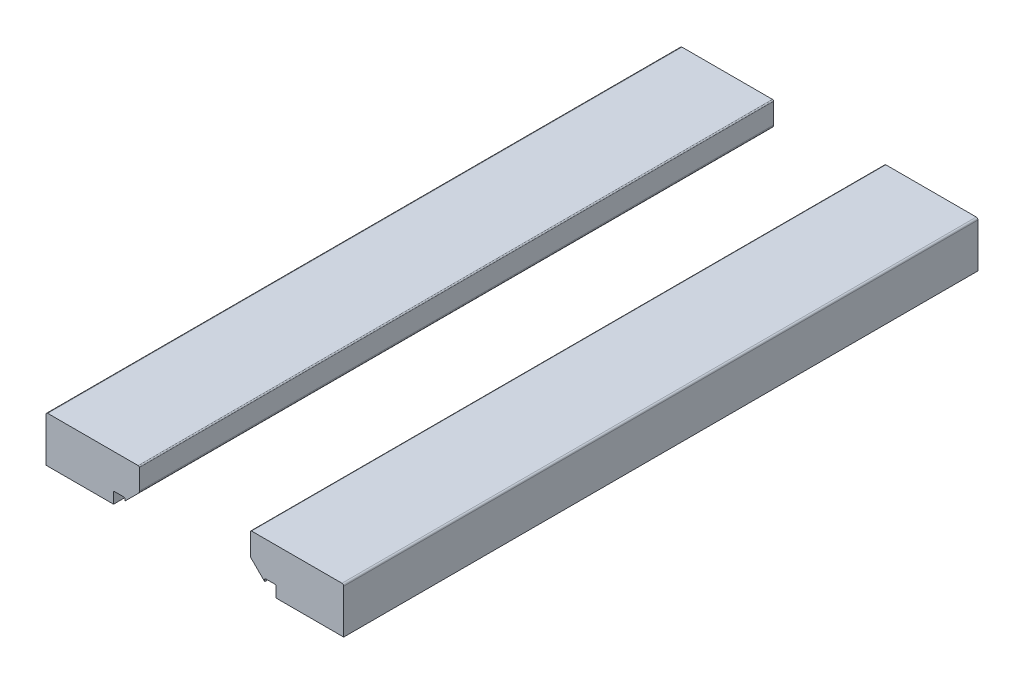
ISO-10303-21;
HEADER;
FILE_DESCRIPTION(('STEP AP214'),'2;1');
FILE_NAME('part.step','',(''),(''),'','','');
FILE_SCHEMA(('AUTOMOTIVE_DESIGN { 1 0 10303 214 1 1 1 1 }'));
ENDSEC;
DATA;
#1=APPLICATION_CONTEXT('core data for automotive mechanical design processes');
#2=APPLICATION_PROTOCOL_DEFINITION('international standard','automotive_design',2000,#1);
#3=PRODUCT_CONTEXT('',#1,'mechanical');
#4=PRODUCT('Part','Part','',(#3));
#5=PRODUCT_RELATED_PRODUCT_CATEGORY('part','',(#4));
#6=PRODUCT_DEFINITION_FORMATION('','',#4);
#7=PRODUCT_DEFINITION_CONTEXT('part definition',#1,'design');
#8=PRODUCT_DEFINITION('design','',#6,#7);
#9=PRODUCT_DEFINITION_SHAPE('','',#8);
#10=(LENGTH_UNIT() NAMED_UNIT(*) SI_UNIT(.MILLI.,.METRE.));
#11=(NAMED_UNIT(*) PLANE_ANGLE_UNIT() SI_UNIT($,.RADIAN.));
#12=(NAMED_UNIT(*) SI_UNIT($,.STERADIAN.) SOLID_ANGLE_UNIT());
#13=UNCERTAINTY_MEASURE_WITH_UNIT(LENGTH_MEASURE(1.E-05),#10,'distance_accuracy_value','');
#14=(GEOMETRIC_REPRESENTATION_CONTEXT(3) GLOBAL_UNCERTAINTY_ASSIGNED_CONTEXT((#13)) GLOBAL_UNIT_ASSIGNED_CONTEXT((#10,
#11,#12)) REPRESENTATION_CONTEXT('',''));
#15=CARTESIAN_POINT('',(0.,0.,0.));
#16=DIRECTION('',(0.,0.,1.));
#17=DIRECTION('',(1.,0.,0.));
#18=AXIS2_PLACEMENT_3D('',#15,#16,#17);
#19=CARTESIAN_POINT('',(-5.15,6.41568542494924,-27.7));
#20=DIRECTION('',(0.,0.,1.));
#21=DIRECTION('',(1.,0.,0.));
#22=AXIS2_PLACEMENT_3D('',#19,#20,#21);
#23=CYLINDRICAL_SURFACE('',#22,0.300000000000001);
#24=CARTESIAN_POINT('',(-5.15,6.41568542494924,27.7));
#25=DIRECTION('',(0.,0.,1.));
#26=DIRECTION('',(-1.,0.,0.));
#27=AXIS2_PLACEMENT_3D('',#24,#25,#26);
#28=CIRCLE('',#27,0.300000000000001);
#29=CARTESIAN_POINT('',(-4.93786796564403,6.20355339059327,27.7));
#30=VERTEX_POINT('',#29);
#31=CARTESIAN_POINT('',(-4.85,6.41568542494923,27.7));
#32=VERTEX_POINT('',#31);
#33=EDGE_CURVE('E171',#30,#32,#28,.T.);
#34=ORIENTED_EDGE('',*,*,#33,.F.);
#35=DIRECTION('',(0.,0.,1.));
#36=VECTOR('',#35,1.);
#37=CARTESIAN_POINT('',(-4.93786796564403,6.20355339059327,-27.7));
#38=LINE('',#37,#36);
#39=CARTESIAN_POINT('',(-4.93786796564403,6.20355339059327,-27.7));
#40=VERTEX_POINT('',#39);
#41=EDGE_CURVE('E12',#40,#30,#38,.T.);
#42=ORIENTED_EDGE('',*,*,#41,.F.);
#43=CARTESIAN_POINT('',(-5.15,6.41568542494924,-27.7));
#44=DIRECTION('',(0.,0.,1.));
#45=DIRECTION('',(-1.,0.,0.));
#46=AXIS2_PLACEMENT_3D('',#43,#44,#45);
#47=CIRCLE('',#46,0.300000000000001);
#48=CARTESIAN_POINT('',(-4.85,6.41568542494923,-27.7));
#49=VERTEX_POINT('',#48);
#50=EDGE_CURVE('E206',#40,#49,#47,.T.);
#51=ORIENTED_EDGE('',*,*,#50,.T.);
#52=DIRECTION('',(0.,0.,1.));
#53=VECTOR('',#52,1.);
#54=CARTESIAN_POINT('',(-4.85,6.41568542494923,-27.7));
#55=LINE('',#54,#53);
#56=EDGE_CURVE('E47',#49,#32,#55,.T.);
#57=ORIENTED_EDGE('',*,*,#56,.T.);
#58=EDGE_LOOP('',(#34,#42,#51,#57));
#59=FACE_BOUND('',#58,.T.);
#60=ADVANCED_FACE('F44',(#59),#23,.T.);
#61=CARTESIAN_POINT('',(-4.93786796564403,6.20355339059327,-27.7));
#62=DIRECTION('',(0.707106781186547,-0.707106781186548,0.));
#63=DIRECTION('',(0.707106781186548,0.707106781186547,0.));
#64=AXIS2_PLACEMENT_3D('',#61,#62,#63);
#65=PLANE('',#64);
#66=DIRECTION('',(0.707106781186548,0.707106781186547,0.));
#67=VECTOR('',#66,1.);
#68=CARTESIAN_POINT('',(-4.93786796564403,6.20355339059327,27.7));
#69=LINE('',#68,#67);
#70=CARTESIAN_POINT('',(-6.1,5.04142135623731,27.7));
#71=VERTEX_POINT('',#70);
#72=EDGE_CURVE('E204',#71,#30,#69,.T.);
#73=ORIENTED_EDGE('',*,*,#72,.F.);
#74=DIRECTION('',(0.,0.,1.));
#75=VECTOR('',#74,1.);
#76=CARTESIAN_POINT('',(-6.1,5.04142135623731,-27.7));
#77=LINE('',#76,#75);
#78=CARTESIAN_POINT('',(-6.1,5.04142135623731,-27.7));
#79=VERTEX_POINT('',#78);
#80=EDGE_CURVE('E53',#79,#71,#77,.T.);
#81=ORIENTED_EDGE('',*,*,#80,.F.);
#82=DIRECTION('',(0.707106781186548,0.707106781186547,0.));
#83=VECTOR('',#82,1.);
#84=CARTESIAN_POINT('',(-4.93786796564403,6.20355339059327,-27.7));
#85=LINE('',#84,#83);
#86=EDGE_CURVE('E161',#79,#40,#85,.T.);
#87=ORIENTED_EDGE('',*,*,#86,.T.);
#88=ORIENTED_EDGE('',*,*,#41,.T.);
#89=EDGE_LOOP('',(#73,#81,#87,#88));
#90=FACE_BOUND('',#89,.T.);
#91=ADVANCED_FACE('F228',(#90),#65,.T.);
#92=CARTESIAN_POINT('',(-6.1,5.2,-27.7));
#93=DIRECTION('',(-1.,0.,0.));
#94=DIRECTION('',(0.,-1.,0.));
#95=AXIS2_PLACEMENT_3D('',#92,#93,#94);
#96=PLANE('',#95);
#97=DIRECTION('',(0.,-1.,0.));
#98=VECTOR('',#97,1.);
#99=CARTESIAN_POINT('',(-6.1,5.2,27.7));
#100=LINE('',#99,#98);
#101=CARTESIAN_POINT('',(-6.1,5.2,27.7));
#102=VERTEX_POINT('',#101);
#103=EDGE_CURVE('E148',#102,#71,#100,.T.);
#104=ORIENTED_EDGE('',*,*,#103,.F.);
#105=DIRECTION('',(0.,0.,1.));
#106=VECTOR('',#105,1.);
#107=CARTESIAN_POINT('',(-6.1,5.2,-27.7));
#108=LINE('',#107,#106);
#109=CARTESIAN_POINT('',(-6.1,5.2,-27.7));
#110=VERTEX_POINT('',#109);
#111=EDGE_CURVE('E143',#110,#102,#108,.T.);
#112=ORIENTED_EDGE('',*,*,#111,.F.);
#113=DIRECTION('',(0.,-1.,0.));
#114=VECTOR('',#113,1.);
#115=CARTESIAN_POINT('',(-6.1,5.2,-27.7));
#116=LINE('',#115,#114);
#117=EDGE_CURVE('E146',#110,#79,#116,.T.);
#118=ORIENTED_EDGE('',*,*,#117,.T.);
#119=ORIENTED_EDGE('',*,*,#80,.T.);
#120=EDGE_LOOP('',(#104,#112,#118,#119));
#121=FACE_BOUND('',#120,.T.);
#122=ADVANCED_FACE('F145',(#121),#96,.T.);
#123=CARTESIAN_POINT('',(-6.2,5.2,-27.7));
#124=DIRECTION('',(0.,0.,1.));
#125=DIRECTION('',(1.,0.,0.));
#126=AXIS2_PLACEMENT_3D('',#123,#124,#125);
#127=CYLINDRICAL_SURFACE('',#126,0.1);
#128=CARTESIAN_POINT('',(-6.2,5.2,27.7));
#129=DIRECTION('',(0.,0.,-1.));
#130=DIRECTION('',(1.,0.,0.));
#131=AXIS2_PLACEMENT_3D('',#128,#129,#130);
#132=CIRCLE('',#131,0.1);
#133=CARTESIAN_POINT('',(-6.2,5.3,27.7));
#134=VERTEX_POINT('',#133);
#135=EDGE_CURVE('E201',#134,#102,#132,.T.);
#136=ORIENTED_EDGE('',*,*,#135,.F.);
#137=DIRECTION('',(0.,0.,1.));
#138=VECTOR('',#137,1.);
#139=CARTESIAN_POINT('',(-6.2,5.3,-27.7));
#140=LINE('',#139,#138);
#141=CARTESIAN_POINT('',(-6.2,5.3,-27.7));
#142=VERTEX_POINT('',#141);
#143=EDGE_CURVE('E153',#142,#134,#140,.T.);
#144=ORIENTED_EDGE('',*,*,#143,.F.);
#145=CARTESIAN_POINT('',(-6.2,5.2,-27.7));
#146=DIRECTION('',(0.,0.,-1.));
#147=DIRECTION('',(1.,0.,0.));
#148=AXIS2_PLACEMENT_3D('',#145,#146,#147);
#149=CIRCLE('',#148,0.1);
#150=EDGE_CURVE('E159',#142,#110,#149,.T.);
#151=ORIENTED_EDGE('',*,*,#150,.T.);
#152=ORIENTED_EDGE('',*,*,#111,.T.);
#153=EDGE_LOOP('',(#136,#144,#151,#152));
#154=FACE_BOUND('',#153,.T.);
#155=ADVANCED_FACE('F163',(#154),#127,.F.);
#156=CARTESIAN_POINT('',(-7.,5.3,-27.7));
#157=DIRECTION('',(0.,-1.,0.));
#158=DIRECTION('',(0.,0.,-1.));
#159=AXIS2_PLACEMENT_3D('',#156,#157,#158);
#160=PLANE('',#159);
#161=DIRECTION('',(1.,0.,0.));
#162=VECTOR('',#161,1.);
#163=CARTESIAN_POINT('',(-7.,5.3,27.7));
#164=LINE('',#163,#162);
#165=CARTESIAN_POINT('',(-7.,5.3,27.7));
#166=VERTEX_POINT('',#165);
#167=EDGE_CURVE('E198',#166,#134,#164,.T.);
#168=ORIENTED_EDGE('',*,*,#167,.F.);
#169=DIRECTION('',(0.,0.,1.));
#170=VECTOR('',#169,1.);
#171=CARTESIAN_POINT('',(-7.,5.3,-27.7));
#172=LINE('',#171,#170);
#173=CARTESIAN_POINT('',(-7.,5.3,-27.7));
#174=VERTEX_POINT('',#173);
#175=EDGE_CURVE('E210',#174,#166,#172,.T.);
#176=ORIENTED_EDGE('',*,*,#175,.F.);
#177=DIRECTION('',(1.,0.,0.));
#178=VECTOR('',#177,1.);
#179=CARTESIAN_POINT('',(-7.,5.3,-27.7));
#180=LINE('',#179,#178);
#181=EDGE_CURVE('E164',#174,#142,#180,.T.);
#182=ORIENTED_EDGE('',*,*,#181,.T.);
#183=ORIENTED_EDGE('',*,*,#143,.T.);
#184=EDGE_LOOP('',(#168,#176,#182,#183));
#185=FACE_BOUND('',#184,.T.);
#186=ADVANCED_FACE('F241',(#185),#160,.T.);
#187=CARTESIAN_POINT('',(-7.,5.2,-27.7));
#188=DIRECTION('',(0.,0.,1.));
#189=DIRECTION('',(1.,0.,0.));
#190=AXIS2_PLACEMENT_3D('',#187,#188,#189);
#191=CYLINDRICAL_SURFACE('',#190,0.1);
#192=CARTESIAN_POINT('',(-7.,5.2,27.7));
#193=DIRECTION('',(0.,0.,-1.));
#194=DIRECTION('',(1.,0.,0.));
#195=AXIS2_PLACEMENT_3D('',#192,#193,#194);
#196=CIRCLE('',#195,0.1);
#197=CARTESIAN_POINT('',(-7.1,5.2,27.7));
#198=VERTEX_POINT('',#197);
#199=EDGE_CURVE('E195',#198,#166,#196,.T.);
#200=ORIENTED_EDGE('',*,*,#199,.F.);
#201=DIRECTION('',(0.,0.,1.));
#202=VECTOR('',#201,1.);
#203=CARTESIAN_POINT('',(-7.1,5.2,-27.7));
#204=LINE('',#203,#202);
#205=CARTESIAN_POINT('',(-7.1,5.2,-27.7));
#206=VERTEX_POINT('',#205);
#207=EDGE_CURVE('E212',#206,#198,#204,.T.);
#208=ORIENTED_EDGE('',*,*,#207,.F.);
#209=CARTESIAN_POINT('',(-7.,5.2,-27.7));
#210=DIRECTION('',(0.,0.,-1.));
#211=DIRECTION('',(1.,0.,0.));
#212=AXIS2_PLACEMENT_3D('',#209,#210,#211);
#213=CIRCLE('',#212,0.1);
#214=EDGE_CURVE('E166',#206,#174,#213,.T.);
#215=ORIENTED_EDGE('',*,*,#214,.T.);
#216=ORIENTED_EDGE('',*,*,#175,.T.);
#217=EDGE_LOOP('',(#200,#208,#215,#216));
#218=FACE_BOUND('',#217,.T.);
#219=ADVANCED_FACE('F244',(#218),#191,.F.);
#220=CARTESIAN_POINT('',(-7.1,4.3,-27.7));
#221=DIRECTION('',(1.,0.,0.));
#222=DIRECTION('',(0.,0.,-1.));
#223=AXIS2_PLACEMENT_3D('',#220,#221,#222);
#224=PLANE('',#223);
#225=DIRECTION('',(0.,1.,0.));
#226=VECTOR('',#225,1.);
#227=CARTESIAN_POINT('',(-7.1,4.3,27.7));
#228=LINE('',#227,#226);
#229=CARTESIAN_POINT('',(-7.1,4.3,27.7));
#230=VERTEX_POINT('',#229);
#231=EDGE_CURVE('E192',#230,#198,#228,.T.);
#232=ORIENTED_EDGE('',*,*,#231,.F.);
#233=DIRECTION('',(0.,0.,1.));
#234=VECTOR('',#233,1.);
#235=CARTESIAN_POINT('',(-7.1,4.3,-27.7));
#236=LINE('',#235,#234);
#237=CARTESIAN_POINT('',(-7.1,4.3,-27.7));
#238=VERTEX_POINT('',#237);
#239=EDGE_CURVE('E214',#238,#230,#236,.T.);
#240=ORIENTED_EDGE('',*,*,#239,.F.);
#241=DIRECTION('',(0.,1.,0.));
#242=VECTOR('',#241,1.);
#243=CARTESIAN_POINT('',(-7.1,4.3,-27.7));
#244=LINE('',#243,#242);
#245=EDGE_CURVE('E384',#238,#206,#244,.T.);
#246=ORIENTED_EDGE('',*,*,#245,.T.);
#247=ORIENTED_EDGE('',*,*,#207,.T.);
#248=EDGE_LOOP('',(#232,#240,#246,#247));
#249=FACE_BOUND('',#248,.T.);
#250=ADVANCED_FACE('F248',(#249),#224,.T.);
#251=CARTESIAN_POINT('',(-7.1,4.3,-27.7));
#252=DIRECTION('',(0.,-1.,0.));
#253=DIRECTION('',(0.,0.,-1.));
#254=AXIS2_PLACEMENT_3D('',#251,#252,#253);
#255=PLANE('',#254);
#256=DIRECTION('',(1.,0.,0.));
#257=VECTOR('',#256,1.);
#258=CARTESIAN_POINT('',(-7.1,4.3,27.7));
#259=LINE('',#258,#257);
#260=CARTESIAN_POINT('',(-13.,4.3,27.7));
#261=VERTEX_POINT('',#260);
#262=EDGE_CURVE('E189',#261,#230,#259,.T.);
#263=ORIENTED_EDGE('',*,*,#262,.F.);
#264=DIRECTION('',(0.,0.,1.));
#265=VECTOR('',#264,1.);
#266=CARTESIAN_POINT('',(-13.,4.3,-27.7));
#267=LINE('',#266,#265);
#268=CARTESIAN_POINT('',(-13.,4.3,-27.7));
#269=VERTEX_POINT('',#268);
#270=EDGE_CURVE('E216',#269,#261,#267,.T.);
#271=ORIENTED_EDGE('',*,*,#270,.F.);
#272=DIRECTION('',(1.,0.,0.));
#273=VECTOR('',#272,1.);
#274=CARTESIAN_POINT('',(-7.1,4.3,-27.7));
#275=LINE('',#274,#273);
#276=EDGE_CURVE('E380',#269,#238,#275,.T.);
#277=ORIENTED_EDGE('',*,*,#276,.T.);
#278=ORIENTED_EDGE('',*,*,#239,.T.);
#279=EDGE_LOOP('',(#263,#271,#277,#278));
#280=FACE_BOUND('',#279,.T.);
#281=ADVANCED_FACE('F252',(#280),#255,.T.);
#282=CARTESIAN_POINT('',(-13.,8.15,-27.7));
#283=DIRECTION('',(-1.,0.,0.));
#284=DIRECTION('',(0.,-1.,0.));
#285=AXIS2_PLACEMENT_3D('',#282,#283,#284);
#286=PLANE('',#285);
#287=DIRECTION('',(0.,-1.,0.));
#288=VECTOR('',#287,1.);
#289=CARTESIAN_POINT('',(-13.,8.15,27.7));
#290=LINE('',#289,#288);
#291=CARTESIAN_POINT('',(-13.,8.15,27.7));
#292=VERTEX_POINT('',#291);
#293=EDGE_CURVE('E186',#292,#261,#290,.T.);
#294=ORIENTED_EDGE('',*,*,#293,.F.);
#295=DIRECTION('',(0.,0.,1.));
#296=VECTOR('',#295,1.);
#297=CARTESIAN_POINT('',(-13.,8.15,-27.7));
#298=LINE('',#297,#296);
#299=CARTESIAN_POINT('',(-13.,8.15,-27.7));
#300=VERTEX_POINT('',#299);
#301=EDGE_CURVE('E218',#300,#292,#298,.T.);
#302=ORIENTED_EDGE('',*,*,#301,.F.);
#303=DIRECTION('',(0.,-1.,0.));
#304=VECTOR('',#303,1.);
#305=CARTESIAN_POINT('',(-13.,8.15,-27.7));
#306=LINE('',#305,#304);
#307=EDGE_CURVE('E391',#300,#269,#306,.T.);
#308=ORIENTED_EDGE('',*,*,#307,.T.);
#309=ORIENTED_EDGE('',*,*,#270,.T.);
#310=EDGE_LOOP('',(#294,#302,#308,#309));
#311=FACE_BOUND('',#310,.T.);
#312=ADVANCED_FACE('F256',(#311),#286,.T.);
#313=CARTESIAN_POINT('',(-12.85,8.15,-27.7));
#314=DIRECTION('',(0.,0.,1.));
#315=DIRECTION('',(1.,0.,0.));
#316=AXIS2_PLACEMENT_3D('',#313,#314,#315);
#317=CYLINDRICAL_SURFACE('',#316,0.15);
#318=CARTESIAN_POINT('',(-12.85,8.15,27.7));
#319=DIRECTION('',(0.,0.,1.));
#320=DIRECTION('',(1.,0.,0.));
#321=AXIS2_PLACEMENT_3D('',#318,#319,#320);
#322=CIRCLE('',#321,0.15);
#323=CARTESIAN_POINT('',(-12.85,8.3,27.7));
#324=VERTEX_POINT('',#323);
#325=EDGE_CURVE('E183',#324,#292,#322,.T.);
#326=ORIENTED_EDGE('',*,*,#325,.F.);
#327=DIRECTION('',(0.,0.,1.));
#328=VECTOR('',#327,1.);
#329=CARTESIAN_POINT('',(-12.85,8.3,-27.7));
#330=LINE('',#329,#328);
#331=CARTESIAN_POINT('',(-12.85,8.3,-27.7));
#332=VERTEX_POINT('',#331);
#333=EDGE_CURVE('E220',#332,#324,#330,.T.);
#334=ORIENTED_EDGE('',*,*,#333,.F.);
#335=CARTESIAN_POINT('',(-12.85,8.15,-27.7));
#336=DIRECTION('',(0.,0.,1.));
#337=DIRECTION('',(1.,0.,0.));
#338=AXIS2_PLACEMENT_3D('',#335,#336,#337);
#339=CIRCLE('',#338,0.15);
#340=EDGE_CURVE('E373',#332,#300,#339,.T.);
#341=ORIENTED_EDGE('',*,*,#340,.T.);
#342=ORIENTED_EDGE('',*,*,#301,.T.);
#343=EDGE_LOOP('',(#326,#334,#341,#342));
#344=FACE_BOUND('',#343,.T.);
#345=ADVANCED_FACE('F260',(#344),#317,.T.);
#346=CARTESIAN_POINT('',(-4.95,8.3,-27.7));
#347=DIRECTION('',(0.,1.,0.));
#348=DIRECTION('',(-1.,0.,0.));
#349=AXIS2_PLACEMENT_3D('',#346,#347,#348);
#350=PLANE('',#349);
#351=DIRECTION('',(-1.,0.,0.));
#352=VECTOR('',#351,1.);
#353=CARTESIAN_POINT('',(-4.95,8.3,27.7));
#354=LINE('',#353,#352);
#355=CARTESIAN_POINT('',(-4.95,8.3,27.7));
#356=VERTEX_POINT('',#355);
#357=EDGE_CURVE('E180',#356,#324,#354,.T.);
#358=ORIENTED_EDGE('',*,*,#357,.F.);
#359=DIRECTION('',(0.,0.,1.));
#360=VECTOR('',#359,1.);
#361=CARTESIAN_POINT('',(-4.95,8.3,-27.7));
#362=LINE('',#361,#360);
#363=CARTESIAN_POINT('',(-4.95,8.3,-27.7));
#364=VERTEX_POINT('',#363);
#365=EDGE_CURVE('E222',#364,#356,#362,.T.);
#366=ORIENTED_EDGE('',*,*,#365,.F.);
#367=DIRECTION('',(-1.,0.,0.));
#368=VECTOR('',#367,1.);
#369=CARTESIAN_POINT('',(-4.95,8.3,-27.7));
#370=LINE('',#369,#368);
#371=EDGE_CURVE('E369',#364,#332,#370,.T.);
#372=ORIENTED_EDGE('',*,*,#371,.T.);
#373=ORIENTED_EDGE('',*,*,#333,.T.);
#374=EDGE_LOOP('',(#358,#366,#372,#373));
#375=FACE_BOUND('',#374,.T.);
#376=ADVANCED_FACE('F264',(#375),#350,.T.);
#377=CARTESIAN_POINT('',(-4.95,8.2,-27.7));
#378=DIRECTION('',(0.,0.,1.));
#379=DIRECTION('',(1.,0.,0.));
#380=AXIS2_PLACEMENT_3D('',#377,#378,#379);
#381=CYLINDRICAL_SURFACE('',#380,0.100000000000001);
#382=CARTESIAN_POINT('',(-4.95,8.2,27.7));
#383=DIRECTION('',(0.,0.,1.));
#384=DIRECTION('',(1.,0.,0.));
#385=AXIS2_PLACEMENT_3D('',#382,#383,#384);
#386=CIRCLE('',#385,0.100000000000001);
#387=CARTESIAN_POINT('',(-4.85,8.2,27.7));
#388=VERTEX_POINT('',#387);
#389=EDGE_CURVE('E177',#388,#356,#386,.T.);
#390=ORIENTED_EDGE('',*,*,#389,.F.);
#391=DIRECTION('',(0.,0.,1.));
#392=VECTOR('',#391,1.);
#393=CARTESIAN_POINT('',(-4.85,8.2,-27.7));
#394=LINE('',#393,#392);
#395=CARTESIAN_POINT('',(-4.85,8.2,-27.7));
#396=VERTEX_POINT('',#395);
#397=EDGE_CURVE('E223',#396,#388,#394,.T.);
#398=ORIENTED_EDGE('',*,*,#397,.F.);
#399=CARTESIAN_POINT('',(-4.95,8.2,-27.7));
#400=DIRECTION('',(0.,0.,1.));
#401=DIRECTION('',(1.,0.,0.));
#402=AXIS2_PLACEMENT_3D('',#399,#400,#401);
#403=CIRCLE('',#402,0.100000000000001);
#404=EDGE_CURVE('E395',#396,#364,#403,.T.);
#405=ORIENTED_EDGE('',*,*,#404,.T.);
#406=ORIENTED_EDGE('',*,*,#365,.T.);
#407=EDGE_LOOP('',(#390,#398,#405,#406));
#408=FACE_BOUND('',#407,.T.);
#409=ADVANCED_FACE('F268',(#408),#381,.T.);
#410=CARTESIAN_POINT('',(-4.85,8.2,-27.7));
#411=DIRECTION('',(1.,0.,0.));
#412=DIRECTION('',(0.,1.,0.));
#413=AXIS2_PLACEMENT_3D('',#410,#411,#412);
#414=PLANE('',#413);
#415=DIRECTION('',(0.,1.,0.));
#416=VECTOR('',#415,1.);
#417=CARTESIAN_POINT('',(-4.85,8.2,27.7));
#418=LINE('',#417,#416);
#419=EDGE_CURVE('E174',#32,#388,#418,.T.);
#420=ORIENTED_EDGE('',*,*,#419,.F.);
#421=ORIENTED_EDGE('',*,*,#56,.F.);
#422=DIRECTION('',(0.,1.,0.));
#423=VECTOR('',#422,1.);
#424=CARTESIAN_POINT('',(-4.85,8.2,-27.7));
#425=LINE('',#424,#423);
#426=EDGE_CURVE('E397',#49,#396,#425,.T.);
#427=ORIENTED_EDGE('',*,*,#426,.T.);
#428=ORIENTED_EDGE('',*,*,#397,.T.);
#429=EDGE_LOOP('',(#420,#421,#427,#428));
#430=FACE_BOUND('',#429,.T.);
#431=ADVANCED_FACE('F225',(#430),#414,.T.);
#432=CARTESIAN_POINT('',(-5.15,6.41568542494924,-27.7));
#433=DIRECTION('',(0.,0.,-1.));
#434=DIRECTION('',(-1.,0.,0.));
#435=AXIS2_PLACEMENT_3D('',#432,#433,#434);
#436=PLANE('',#435);
#437=ORIENTED_EDGE('',*,*,#50,.F.);
#438=ORIENTED_EDGE('',*,*,#86,.F.);
#439=ORIENTED_EDGE('',*,*,#117,.F.);
#440=ORIENTED_EDGE('',*,*,#150,.F.);
#441=ORIENTED_EDGE('',*,*,#181,.F.);
#442=ORIENTED_EDGE('',*,*,#214,.F.);
#443=ORIENTED_EDGE('',*,*,#245,.F.);
#444=ORIENTED_EDGE('',*,*,#276,.F.);
#445=ORIENTED_EDGE('',*,*,#307,.F.);
#446=ORIENTED_EDGE('',*,*,#340,.F.);
#447=ORIENTED_EDGE('',*,*,#371,.F.);
#448=ORIENTED_EDGE('',*,*,#404,.F.);
#449=ORIENTED_EDGE('',*,*,#426,.F.);
#450=EDGE_LOOP('',(#437,#438,#439,#440,#441,#442,#443,#444,#445,#446,#447,#448,#449));
#451=FACE_BOUND('',#450,.T.);
#452=ADVANCED_FACE('F157',(#451),#436,.T.);
#453=CARTESIAN_POINT('',(-5.15,6.41568542494924,27.7));
#454=DIRECTION('',(0.,0.,-1.));
#455=DIRECTION('',(-1.,0.,0.));
#456=AXIS2_PLACEMENT_3D('',#453,#454,#455);
#457=PLANE('',#456);
#458=ORIENTED_EDGE('',*,*,#33,.T.);
#459=ORIENTED_EDGE('',*,*,#419,.T.);
#460=ORIENTED_EDGE('',*,*,#389,.T.);
#461=ORIENTED_EDGE('',*,*,#357,.T.);
#462=ORIENTED_EDGE('',*,*,#325,.T.);
#463=ORIENTED_EDGE('',*,*,#293,.T.);
#464=ORIENTED_EDGE('',*,*,#262,.T.);
#465=ORIENTED_EDGE('',*,*,#231,.T.);
#466=ORIENTED_EDGE('',*,*,#199,.T.);
#467=ORIENTED_EDGE('',*,*,#167,.T.);
#468=ORIENTED_EDGE('',*,*,#135,.T.);
#469=ORIENTED_EDGE('',*,*,#103,.T.);
#470=ORIENTED_EDGE('',*,*,#72,.T.);
#471=EDGE_LOOP('',(#458,#459,#460,#461,#462,#463,#464,#465,#466,#467,#468,#469,#470));
#472=FACE_BOUND('',#471,.T.);
#473=ADVANCED_FACE('F227',(#472),#457,.F.);
#474=CLOSED_SHELL('',(#60,#91,#122,#155,#186,#219,#250,#281,#312,#345,#376,#409,#431,#452,#473));
#475=MANIFOLD_SOLID_BREP('B2',#474);
#476=CARTESIAN_POINT('',(12.85,8.15,-27.7));
#477=DIRECTION('',(0.,0.,1.));
#478=DIRECTION('',(1.,0.,0.));
#479=AXIS2_PLACEMENT_3D('',#476,#477,#478);
#480=CYLINDRICAL_SURFACE('',#479,0.15);
#481=CARTESIAN_POINT('',(12.85,8.15,27.7));
#482=DIRECTION('',(0.,0.,1.));
#483=DIRECTION('',(-1.,0.,0.));
#484=AXIS2_PLACEMENT_3D('',#481,#482,#483);
#485=CIRCLE('',#484,0.15);
#486=CARTESIAN_POINT('',(13.,8.15,27.7));
#487=VERTEX_POINT('',#486);
#488=CARTESIAN_POINT('',(12.85,8.3,27.7));
#489=VERTEX_POINT('',#488);
#490=EDGE_CURVE('E528',#487,#489,#485,.T.);
#491=ORIENTED_EDGE('',*,*,#490,.F.);
#492=DIRECTION('',(0.,0.,1.));
#493=VECTOR('',#492,1.);
#494=CARTESIAN_POINT('',(13.,8.15,-27.7));
#495=LINE('',#494,#493);
#496=CARTESIAN_POINT('',(13.,8.15,-27.7));
#497=VERTEX_POINT('',#496);
#498=EDGE_CURVE('E42',#497,#487,#495,.T.);
#499=ORIENTED_EDGE('',*,*,#498,.F.);
#500=CARTESIAN_POINT('',(12.85,8.15,-27.7));
#501=DIRECTION('',(0.,0.,1.));
#502=DIRECTION('',(-1.,0.,0.));
#503=AXIS2_PLACEMENT_3D('',#500,#501,#502);
#504=CIRCLE('',#503,0.15);
#505=CARTESIAN_POINT('',(12.85,8.3,-27.7));
#506=VERTEX_POINT('',#505);
#507=EDGE_CURVE('E563',#497,#506,#504,.T.);
#508=ORIENTED_EDGE('',*,*,#507,.T.);
#509=DIRECTION('',(0.,0.,1.));
#510=VECTOR('',#509,1.);
#511=CARTESIAN_POINT('',(12.85,8.3,-27.7));
#512=LINE('',#511,#510);
#513=EDGE_CURVE('E404',#506,#489,#512,.T.);
#514=ORIENTED_EDGE('',*,*,#513,.T.);
#515=EDGE_LOOP('',(#491,#499,#508,#514));
#516=FACE_BOUND('',#515,.T.);
#517=ADVANCED_FACE('F401',(#516),#480,.T.);
#518=CARTESIAN_POINT('',(13.,8.15,-27.7));
#519=DIRECTION('',(1.,0.,0.));
#520=DIRECTION('',(0.,1.,0.));
#521=AXIS2_PLACEMENT_3D('',#518,#519,#520);
#522=PLANE('',#521);
#523=DIRECTION('',(0.,1.,0.));
#524=VECTOR('',#523,1.);
#525=CARTESIAN_POINT('',(13.,8.15,27.7));
#526=LINE('',#525,#524);
#527=CARTESIAN_POINT('',(13.,4.3,27.7));
#528=VERTEX_POINT('',#527);
#529=EDGE_CURVE('E561',#528,#487,#526,.T.);
#530=ORIENTED_EDGE('',*,*,#529,.F.);
#531=DIRECTION('',(0.,0.,1.));
#532=VECTOR('',#531,1.);
#533=CARTESIAN_POINT('',(13.,4.3,-27.7));
#534=LINE('',#533,#532);
#535=CARTESIAN_POINT('',(13.,4.3,-27.7));
#536=VERTEX_POINT('',#535);
#537=EDGE_CURVE('E410',#536,#528,#534,.T.);
#538=ORIENTED_EDGE('',*,*,#537,.F.);
#539=DIRECTION('',(0.,1.,0.));
#540=VECTOR('',#539,1.);
#541=CARTESIAN_POINT('',(13.,8.15,-27.7));
#542=LINE('',#541,#540);
#543=EDGE_CURVE('E518',#536,#497,#542,.T.);
#544=ORIENTED_EDGE('',*,*,#543,.T.);
#545=ORIENTED_EDGE('',*,*,#498,.T.);
#546=EDGE_LOOP('',(#530,#538,#544,#545));
#547=FACE_BOUND('',#546,.T.);
#548=ADVANCED_FACE('F585',(#547),#522,.T.);
#549=CARTESIAN_POINT('',(7.1,4.3,-27.7));
#550=DIRECTION('',(0.,-1.,0.));
#551=DIRECTION('',(0.,0.,-1.));
#552=AXIS2_PLACEMENT_3D('',#549,#550,#551);
#553=PLANE('',#552);
#554=DIRECTION('',(1.,0.,0.));
#555=VECTOR('',#554,1.);
#556=CARTESIAN_POINT('',(7.1,4.3,27.7));
#557=LINE('',#556,#555);
#558=CARTESIAN_POINT('',(7.1,4.3,27.7));
#559=VERTEX_POINT('',#558);
#560=EDGE_CURVE('E505',#559,#528,#557,.T.);
#561=ORIENTED_EDGE('',*,*,#560,.F.);
#562=DIRECTION('',(0.,0.,1.));
#563=VECTOR('',#562,1.);
#564=CARTESIAN_POINT('',(7.1,4.3,-27.7));
#565=LINE('',#564,#563);
#566=CARTESIAN_POINT('',(7.1,4.3,-27.7));
#567=VERTEX_POINT('',#566);
#568=EDGE_CURVE('E500',#567,#559,#565,.T.);
#569=ORIENTED_EDGE('',*,*,#568,.F.);
#570=DIRECTION('',(1.,0.,0.));
#571=VECTOR('',#570,1.);
#572=CARTESIAN_POINT('',(7.1,4.3,-27.7));
#573=LINE('',#572,#571);
#574=EDGE_CURVE('E503',#567,#536,#573,.T.);
#575=ORIENTED_EDGE('',*,*,#574,.T.);
#576=ORIENTED_EDGE('',*,*,#537,.T.);
#577=EDGE_LOOP('',(#561,#569,#575,#576));
#578=FACE_BOUND('',#577,.T.);
#579=ADVANCED_FACE('F502',(#578),#553,.T.);
#580=CARTESIAN_POINT('',(7.1,4.3,-27.7));
#581=DIRECTION('',(-1.,0.,0.));
#582=DIRECTION('',(0.,0.,1.));
#583=AXIS2_PLACEMENT_3D('',#580,#581,#582);
#584=PLANE('',#583);
#585=DIRECTION('',(0.,-1.,0.));
#586=VECTOR('',#585,1.);
#587=CARTESIAN_POINT('',(7.1,4.3,27.7));
#588=LINE('',#587,#586);
#589=CARTESIAN_POINT('',(7.1,5.2,27.7));
#590=VERTEX_POINT('',#589);
#591=EDGE_CURVE('E558',#590,#559,#588,.T.);
#592=ORIENTED_EDGE('',*,*,#591,.F.);
#593=DIRECTION('',(0.,0.,1.));
#594=VECTOR('',#593,1.);
#595=CARTESIAN_POINT('',(7.1,5.2,-27.7));
#596=LINE('',#595,#594);
#597=CARTESIAN_POINT('',(7.1,5.2,-27.7));
#598=VERTEX_POINT('',#597);
#599=EDGE_CURVE('E510',#598,#590,#596,.T.);
#600=ORIENTED_EDGE('',*,*,#599,.F.);
#601=DIRECTION('',(0.,-1.,0.));
#602=VECTOR('',#601,1.);
#603=CARTESIAN_POINT('',(7.1,4.3,-27.7));
#604=LINE('',#603,#602);
#605=EDGE_CURVE('E516',#598,#567,#604,.T.);
#606=ORIENTED_EDGE('',*,*,#605,.T.);
#607=ORIENTED_EDGE('',*,*,#568,.T.);
#608=EDGE_LOOP('',(#592,#600,#606,#607));
#609=FACE_BOUND('',#608,.T.);
#610=ADVANCED_FACE('F520',(#609),#584,.T.);
#611=CARTESIAN_POINT('',(7.,5.2,-27.7));
#612=DIRECTION('',(0.,0.,1.));
#613=DIRECTION('',(1.,0.,0.));
#614=AXIS2_PLACEMENT_3D('',#611,#612,#613);
#615=CYLINDRICAL_SURFACE('',#614,0.1);
#616=CARTESIAN_POINT('',(7.,5.2,27.7));
#617=DIRECTION('',(0.,0.,-1.));
#618=DIRECTION('',(-1.,0.,0.));
#619=AXIS2_PLACEMENT_3D('',#616,#617,#618);
#620=CIRCLE('',#619,0.1);
#621=CARTESIAN_POINT('',(7.,5.3,27.7));
#622=VERTEX_POINT('',#621);
#623=EDGE_CURVE('E555',#622,#590,#620,.T.);
#624=ORIENTED_EDGE('',*,*,#623,.F.);
#625=DIRECTION('',(0.,0.,1.));
#626=VECTOR('',#625,1.);
#627=CARTESIAN_POINT('',(7.,5.3,-27.7));
#628=LINE('',#627,#626);
#629=CARTESIAN_POINT('',(7.,5.3,-27.7));
#630=VERTEX_POINT('',#629);
#631=EDGE_CURVE('E567',#630,#622,#628,.T.);
#632=ORIENTED_EDGE('',*,*,#631,.F.);
#633=CARTESIAN_POINT('',(7.,5.2,-27.7));
#634=DIRECTION('',(0.,0.,-1.));
#635=DIRECTION('',(-1.,0.,0.));
#636=AXIS2_PLACEMENT_3D('',#633,#634,#635);
#637=CIRCLE('',#636,0.1);
#638=EDGE_CURVE('E521',#630,#598,#637,.T.);
#639=ORIENTED_EDGE('',*,*,#638,.T.);
#640=ORIENTED_EDGE('',*,*,#599,.T.);
#641=EDGE_LOOP('',(#624,#632,#639,#640));
#642=FACE_BOUND('',#641,.T.);
#643=ADVANCED_FACE('F598',(#642),#615,.F.);
#644=CARTESIAN_POINT('',(7.,5.3,-27.7));
#645=DIRECTION('',(0.,-1.,0.));
#646=DIRECTION('',(0.,0.,-1.));
#647=AXIS2_PLACEMENT_3D('',#644,#645,#646);
#648=PLANE('',#647);
#649=DIRECTION('',(1.,0.,0.));
#650=VECTOR('',#649,1.);
#651=CARTESIAN_POINT('',(7.,5.3,27.7));
#652=LINE('',#651,#650);
#653=CARTESIAN_POINT('',(6.2,5.3,27.7));
#654=VERTEX_POINT('',#653);
#655=EDGE_CURVE('E552',#654,#622,#652,.T.);
#656=ORIENTED_EDGE('',*,*,#655,.F.);
#657=DIRECTION('',(0.,0.,1.));
#658=VECTOR('',#657,1.);
#659=CARTESIAN_POINT('',(6.2,5.3,-27.7));
#660=LINE('',#659,#658);
#661=CARTESIAN_POINT('',(6.2,5.3,-27.7));
#662=VERTEX_POINT('',#661);
#663=EDGE_CURVE('E569',#662,#654,#660,.T.);
#664=ORIENTED_EDGE('',*,*,#663,.F.);
#665=DIRECTION('',(1.,0.,0.));
#666=VECTOR('',#665,1.);
#667=CARTESIAN_POINT('',(7.,5.3,-27.7));
#668=LINE('',#667,#666);
#669=EDGE_CURVE('E523',#662,#630,#668,.T.);
#670=ORIENTED_EDGE('',*,*,#669,.T.);
#671=ORIENTED_EDGE('',*,*,#631,.T.);
#672=EDGE_LOOP('',(#656,#664,#670,#671));
#673=FACE_BOUND('',#672,.T.);
#674=ADVANCED_FACE('F601',(#673),#648,.T.);
#675=CARTESIAN_POINT('',(6.2,5.2,-27.7));
#676=DIRECTION('',(0.,0.,1.));
#677=DIRECTION('',(1.,0.,0.));
#678=AXIS2_PLACEMENT_3D('',#675,#676,#677);
#679=CYLINDRICAL_SURFACE('',#678,0.1);
#680=CARTESIAN_POINT('',(6.2,5.2,27.7));
#681=DIRECTION('',(0.,0.,-1.));
#682=DIRECTION('',(-1.,0.,0.));
#683=AXIS2_PLACEMENT_3D('',#680,#681,#682);
#684=CIRCLE('',#683,0.1);
#685=CARTESIAN_POINT('',(6.1,5.2,27.7));
#686=VERTEX_POINT('',#685);
#687=EDGE_CURVE('E549',#686,#654,#684,.T.);
#688=ORIENTED_EDGE('',*,*,#687,.F.);
#689=DIRECTION('',(0.,0.,1.));
#690=VECTOR('',#689,1.);
#691=CARTESIAN_POINT('',(6.1,5.2,-27.7));
#692=LINE('',#691,#690);
#693=CARTESIAN_POINT('',(6.1,5.2,-27.7));
#694=VERTEX_POINT('',#693);
#695=EDGE_CURVE('E571',#694,#686,#692,.T.);
#696=ORIENTED_EDGE('',*,*,#695,.F.);
#697=CARTESIAN_POINT('',(6.2,5.2,-27.7));
#698=DIRECTION('',(0.,0.,-1.));
#699=DIRECTION('',(-1.,0.,0.));
#700=AXIS2_PLACEMENT_3D('',#697,#698,#699);
#701=CIRCLE('',#700,0.1);
#702=EDGE_CURVE('E741',#694,#662,#701,.T.);
#703=ORIENTED_EDGE('',*,*,#702,.T.);
#704=ORIENTED_EDGE('',*,*,#663,.T.);
#705=EDGE_LOOP('',(#688,#696,#703,#704));
#706=FACE_BOUND('',#705,.T.);
#707=ADVANCED_FACE('F605',(#706),#679,.F.);
#708=CARTESIAN_POINT('',(6.1,5.2,-27.7));
#709=DIRECTION('',(1.,0.,0.));
#710=DIRECTION('',(0.,1.,0.));
#711=AXIS2_PLACEMENT_3D('',#708,#709,#710);
#712=PLANE('',#711);
#713=DIRECTION('',(0.,1.,0.));
#714=VECTOR('',#713,1.);
#715=CARTESIAN_POINT('',(6.1,5.2,27.7));
#716=LINE('',#715,#714);
#717=CARTESIAN_POINT('',(6.1,5.04142135623731,27.7));
#718=VERTEX_POINT('',#717);
#719=EDGE_CURVE('E546',#718,#686,#716,.T.);
#720=ORIENTED_EDGE('',*,*,#719,.F.);
#721=DIRECTION('',(0.,0.,1.));
#722=VECTOR('',#721,1.);
#723=CARTESIAN_POINT('',(6.1,5.04142135623731,-27.7));
#724=LINE('',#723,#722);
#725=CARTESIAN_POINT('',(6.1,5.04142135623731,-27.7));
#726=VERTEX_POINT('',#725);
#727=EDGE_CURVE('E573',#726,#718,#724,.T.);
#728=ORIENTED_EDGE('',*,*,#727,.F.);
#729=DIRECTION('',(0.,1.,0.));
#730=VECTOR('',#729,1.);
#731=CARTESIAN_POINT('',(6.1,5.2,-27.7));
#732=LINE('',#731,#730);
#733=EDGE_CURVE('E737',#726,#694,#732,.T.);
#734=ORIENTED_EDGE('',*,*,#733,.T.);
#735=ORIENTED_EDGE('',*,*,#695,.T.);
#736=EDGE_LOOP('',(#720,#728,#734,#735));
#737=FACE_BOUND('',#736,.T.);
#738=ADVANCED_FACE('F609',(#737),#712,.T.);
#739=CARTESIAN_POINT('',(4.93786796564403,6.20355339059327,-27.7));
#740=DIRECTION('',(-0.707106781186547,-0.707106781186548,0.));
#741=DIRECTION('',(0.707106781186548,-0.707106781186547,0.));
#742=AXIS2_PLACEMENT_3D('',#739,#740,#741);
#743=PLANE('',#742);
#744=DIRECTION('',(0.707106781186548,-0.707106781186547,0.));
#745=VECTOR('',#744,1.);
#746=CARTESIAN_POINT('',(4.93786796564403,6.20355339059327,27.7));
#747=LINE('',#746,#745);
#748=CARTESIAN_POINT('',(4.93786796564404,6.20355339059327,27.7));
#749=VERTEX_POINT('',#748);
#750=EDGE_CURVE('E543',#749,#718,#747,.T.);
#751=ORIENTED_EDGE('',*,*,#750,.F.);
#752=DIRECTION('',(0.,0.,1.));
#753=VECTOR('',#752,1.);
#754=CARTESIAN_POINT('',(4.93786796564404,6.20355339059327,-27.7));
#755=LINE('',#754,#753);
#756=CARTESIAN_POINT('',(4.93786796564404,6.20355339059327,-27.7));
#757=VERTEX_POINT('',#756);
#758=EDGE_CURVE('E575',#757,#749,#755,.T.);
#759=ORIENTED_EDGE('',*,*,#758,.F.);
#760=DIRECTION('',(0.707106781186548,-0.707106781186547,0.));
#761=VECTOR('',#760,1.);
#762=CARTESIAN_POINT('',(4.93786796564403,6.20355339059327,-27.7));
#763=LINE('',#762,#761);
#764=EDGE_CURVE('E748',#757,#726,#763,.T.);
#765=ORIENTED_EDGE('',*,*,#764,.T.);
#766=ORIENTED_EDGE('',*,*,#727,.T.);
#767=EDGE_LOOP('',(#751,#759,#765,#766));
#768=FACE_BOUND('',#767,.T.);
#769=ADVANCED_FACE('F613',(#768),#743,.T.);
#770=CARTESIAN_POINT('',(5.15,6.41568542494924,-27.7));
#771=DIRECTION('',(0.,0.,1.));
#772=DIRECTION('',(1.,0.,0.));
#773=AXIS2_PLACEMENT_3D('',#770,#771,#772);
#774=CYLINDRICAL_SURFACE('',#773,0.300000000000001);
#775=CARTESIAN_POINT('',(5.15,6.41568542494924,27.7));
#776=DIRECTION('',(0.,0.,1.));
#777=DIRECTION('',(1.,0.,0.));
#778=AXIS2_PLACEMENT_3D('',#775,#776,#777);
#779=CIRCLE('',#778,0.300000000000001);
#780=CARTESIAN_POINT('',(4.85,6.41568542494923,27.7));
#781=VERTEX_POINT('',#780);
#782=EDGE_CURVE('E540',#781,#749,#779,.T.);
#783=ORIENTED_EDGE('',*,*,#782,.F.);
#784=DIRECTION('',(0.,0.,1.));
#785=VECTOR('',#784,1.);
#786=CARTESIAN_POINT('',(4.85,6.41568542494923,-27.7));
#787=LINE('',#786,#785);
#788=CARTESIAN_POINT('',(4.85,6.41568542494923,-27.7));
#789=VERTEX_POINT('',#788);
#790=EDGE_CURVE('E577',#789,#781,#787,.T.);
#791=ORIENTED_EDGE('',*,*,#790,.F.);
#792=CARTESIAN_POINT('',(5.15,6.41568542494924,-27.7));
#793=DIRECTION('',(0.,0.,1.));
#794=DIRECTION('',(1.,0.,0.));
#795=AXIS2_PLACEMENT_3D('',#792,#793,#794);
#796=CIRCLE('',#795,0.300000000000001);
#797=EDGE_CURVE('E730',#789,#757,#796,.T.);
#798=ORIENTED_EDGE('',*,*,#797,.T.);
#799=ORIENTED_EDGE('',*,*,#758,.T.);
#800=EDGE_LOOP('',(#783,#791,#798,#799));
#801=FACE_BOUND('',#800,.T.);
#802=ADVANCED_FACE('F617',(#801),#774,.T.);
#803=CARTESIAN_POINT('',(4.85,8.2,-27.7));
#804=DIRECTION('',(-1.,0.,0.));
#805=DIRECTION('',(0.,-1.,0.));
#806=AXIS2_PLACEMENT_3D('',#803,#804,#805);
#807=PLANE('',#806);
#808=DIRECTION('',(0.,-1.,0.));
#809=VECTOR('',#808,1.);
#810=CARTESIAN_POINT('',(4.85,8.2,27.7));
#811=LINE('',#810,#809);
#812=CARTESIAN_POINT('',(4.85,8.2,27.7));
#813=VERTEX_POINT('',#812);
#814=EDGE_CURVE('E537',#813,#781,#811,.T.);
#815=ORIENTED_EDGE('',*,*,#814,.F.);
#816=DIRECTION('',(0.,0.,1.));
#817=VECTOR('',#816,1.);
#818=CARTESIAN_POINT('',(4.85,8.2,-27.7));
#819=LINE('',#818,#817);
#820=CARTESIAN_POINT('',(4.85,8.2,-27.7));
#821=VERTEX_POINT('',#820);
#822=EDGE_CURVE('E579',#821,#813,#819,.T.);
#823=ORIENTED_EDGE('',*,*,#822,.F.);
#824=DIRECTION('',(0.,-1.,0.));
#825=VECTOR('',#824,1.);
#826=CARTESIAN_POINT('',(4.85,8.2,-27.7));
#827=LINE('',#826,#825);
#828=EDGE_CURVE('E726',#821,#789,#827,.T.);
#829=ORIENTED_EDGE('',*,*,#828,.T.);
#830=ORIENTED_EDGE('',*,*,#790,.T.);
#831=EDGE_LOOP('',(#815,#823,#829,#830));
#832=FACE_BOUND('',#831,.T.);
#833=ADVANCED_FACE('F621',(#832),#807,.T.);
#834=CARTESIAN_POINT('',(4.95,8.2,-27.7));
#835=DIRECTION('',(0.,0.,1.));
#836=DIRECTION('',(1.,0.,0.));
#837=AXIS2_PLACEMENT_3D('',#834,#835,#836);
#838=CYLINDRICAL_SURFACE('',#837,0.100000000000001);
#839=CARTESIAN_POINT('',(4.95,8.2,27.7));
#840=DIRECTION('',(0.,0.,1.));
#841=DIRECTION('',(-1.,0.,0.));
#842=AXIS2_PLACEMENT_3D('',#839,#840,#841);
#843=CIRCLE('',#842,0.100000000000001);
#844=CARTESIAN_POINT('',(4.95,8.3,27.7));
#845=VERTEX_POINT('',#844);
#846=EDGE_CURVE('E534',#845,#813,#843,.T.);
#847=ORIENTED_EDGE('',*,*,#846,.F.);
#848=DIRECTION('',(0.,0.,1.));
#849=VECTOR('',#848,1.);
#850=CARTESIAN_POINT('',(4.95,8.3,-27.7));
#851=LINE('',#850,#849);
#852=CARTESIAN_POINT('',(4.95,8.3,-27.7));
#853=VERTEX_POINT('',#852);
#854=EDGE_CURVE('E580',#853,#845,#851,.T.);
#855=ORIENTED_EDGE('',*,*,#854,.F.);
#856=CARTESIAN_POINT('',(4.95,8.2,-27.7));
#857=DIRECTION('',(0.,0.,1.));
#858=DIRECTION('',(-1.,0.,0.));
#859=AXIS2_PLACEMENT_3D('',#856,#857,#858);
#860=CIRCLE('',#859,0.100000000000001);
#861=EDGE_CURVE('E752',#853,#821,#860,.T.);
#862=ORIENTED_EDGE('',*,*,#861,.T.);
#863=ORIENTED_EDGE('',*,*,#822,.T.);
#864=EDGE_LOOP('',(#847,#855,#862,#863));
#865=FACE_BOUND('',#864,.T.);
#866=ADVANCED_FACE('F625',(#865),#838,.T.);
#867=CARTESIAN_POINT('',(4.95,8.3,-27.7));
#868=DIRECTION('',(0.,1.,0.));
#869=DIRECTION('',(-1.,0.,0.));
#870=AXIS2_PLACEMENT_3D('',#867,#868,#869);
#871=PLANE('',#870);
#872=DIRECTION('',(-1.,0.,0.));
#873=VECTOR('',#872,1.);
#874=CARTESIAN_POINT('',(4.95,8.3,27.7));
#875=LINE('',#874,#873);
#876=EDGE_CURVE('E531',#489,#845,#875,.T.);
#877=ORIENTED_EDGE('',*,*,#876,.F.);
#878=ORIENTED_EDGE('',*,*,#513,.F.);
#879=DIRECTION('',(-1.,0.,0.));
#880=VECTOR('',#879,1.);
#881=CARTESIAN_POINT('',(4.95,8.3,-27.7));
#882=LINE('',#881,#880);
#883=EDGE_CURVE('E754',#506,#853,#882,.T.);
#884=ORIENTED_EDGE('',*,*,#883,.T.);
#885=ORIENTED_EDGE('',*,*,#854,.T.);
#886=EDGE_LOOP('',(#877,#878,#884,#885));
#887=FACE_BOUND('',#886,.T.);
#888=ADVANCED_FACE('F582',(#887),#871,.T.);
#889=CARTESIAN_POINT('',(12.85,8.15,-27.7));
#890=DIRECTION('',(0.,0.,-1.));
#891=DIRECTION('',(-1.,0.,0.));
#892=AXIS2_PLACEMENT_3D('',#889,#890,#891);
#893=PLANE('',#892);
#894=ORIENTED_EDGE('',*,*,#507,.F.);
#895=ORIENTED_EDGE('',*,*,#543,.F.);
#896=ORIENTED_EDGE('',*,*,#574,.F.);
#897=ORIENTED_EDGE('',*,*,#605,.F.);
#898=ORIENTED_EDGE('',*,*,#638,.F.);
#899=ORIENTED_EDGE('',*,*,#669,.F.);
#900=ORIENTED_EDGE('',*,*,#702,.F.);
#901=ORIENTED_EDGE('',*,*,#733,.F.);
#902=ORIENTED_EDGE('',*,*,#764,.F.);
#903=ORIENTED_EDGE('',*,*,#797,.F.);
#904=ORIENTED_EDGE('',*,*,#828,.F.);
#905=ORIENTED_EDGE('',*,*,#861,.F.);
#906=ORIENTED_EDGE('',*,*,#883,.F.);
#907=EDGE_LOOP('',(#894,#895,#896,#897,#898,#899,#900,#901,#902,#903,#904,#905,#906));
#908=FACE_BOUND('',#907,.T.);
#909=ADVANCED_FACE('F514',(#908),#893,.T.);
#910=CARTESIAN_POINT('',(12.85,8.15,27.7));
#911=DIRECTION('',(0.,0.,-1.));
#912=DIRECTION('',(-1.,0.,0.));
#913=AXIS2_PLACEMENT_3D('',#910,#911,#912);
#914=PLANE('',#913);
#915=ORIENTED_EDGE('',*,*,#490,.T.);
#916=ORIENTED_EDGE('',*,*,#876,.T.);
#917=ORIENTED_EDGE('',*,*,#846,.T.);
#918=ORIENTED_EDGE('',*,*,#814,.T.);
#919=ORIENTED_EDGE('',*,*,#782,.T.);
#920=ORIENTED_EDGE('',*,*,#750,.T.);
#921=ORIENTED_EDGE('',*,*,#719,.T.);
#922=ORIENTED_EDGE('',*,*,#687,.T.);
#923=ORIENTED_EDGE('',*,*,#655,.T.);
#924=ORIENTED_EDGE('',*,*,#623,.T.);
#925=ORIENTED_EDGE('',*,*,#591,.T.);
#926=ORIENTED_EDGE('',*,*,#560,.T.);
#927=ORIENTED_EDGE('',*,*,#529,.T.);
#928=EDGE_LOOP('',(#915,#916,#917,#918,#919,#920,#921,#922,#923,#924,#925,#926,#927));
#929=FACE_BOUND('',#928,.T.);
#930=ADVANCED_FACE('F584',(#929),#914,.F.);
#931=CLOSED_SHELL('',(#517,#548,#579,#610,#643,#674,#707,#738,#769,#802,#833,#866,#888,#909,#930));
#932=MANIFOLD_SOLID_BREP('B6',#931);
#933=ADVANCED_BREP_SHAPE_REPRESENTATION('',(#18,#475,#932),#14);
#934=SHAPE_DEFINITION_REPRESENTATION(#9,#933);
ENDSEC;
END-ISO-10303-21;
